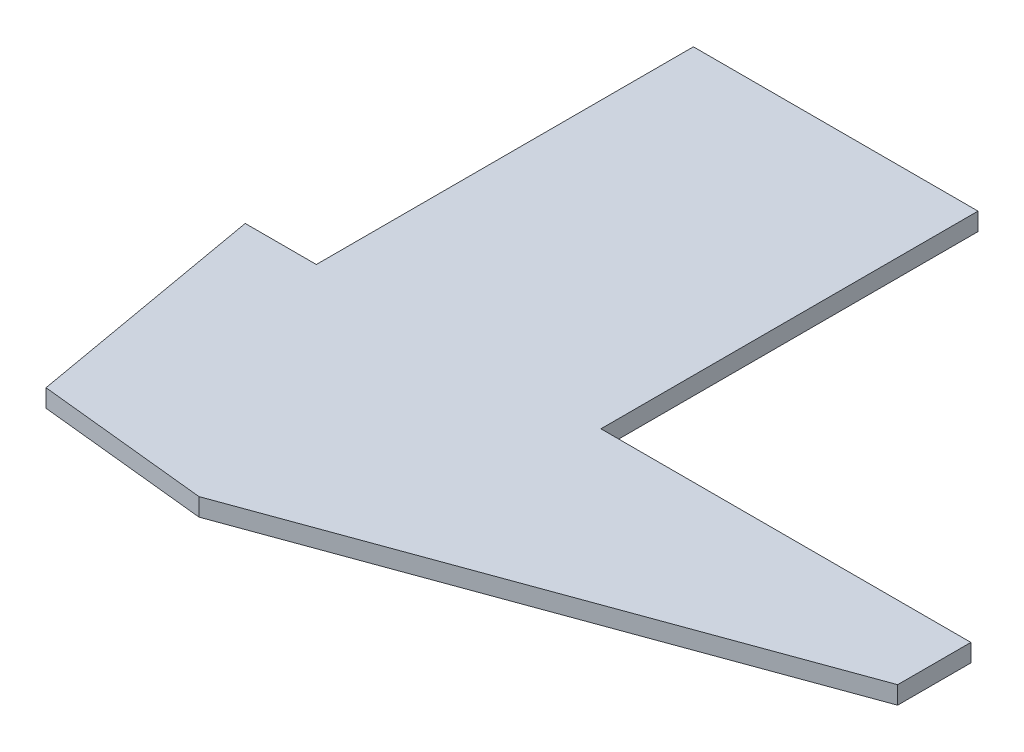
ISO-10303-21;
HEADER;
FILE_DESCRIPTION(('STEP AP214'),'2;1');
FILE_NAME('part.step','',(''),(''),'','','');
FILE_SCHEMA(('AUTOMOTIVE_DESIGN { 1 0 10303 214 1 1 1 1 }'));
ENDSEC;
DATA;
#1=APPLICATION_CONTEXT('core data for automotive mechanical design processes');
#2=APPLICATION_PROTOCOL_DEFINITION('international standard','automotive_design',2000,#1);
#3=PRODUCT_CONTEXT('',#1,'mechanical');
#4=PRODUCT('Part','Part','',(#3));
#5=PRODUCT_RELATED_PRODUCT_CATEGORY('part','',(#4));
#6=PRODUCT_DEFINITION_FORMATION('','',#4);
#7=PRODUCT_DEFINITION_CONTEXT('part definition',#1,'design');
#8=PRODUCT_DEFINITION('design','',#6,#7);
#9=PRODUCT_DEFINITION_SHAPE('','',#8);
#10=(LENGTH_UNIT() NAMED_UNIT(*) SI_UNIT(.MILLI.,.METRE.));
#11=(NAMED_UNIT(*) PLANE_ANGLE_UNIT() SI_UNIT($,.RADIAN.));
#12=(NAMED_UNIT(*) SI_UNIT($,.STERADIAN.) SOLID_ANGLE_UNIT());
#13=UNCERTAINTY_MEASURE_WITH_UNIT(LENGTH_MEASURE(1.E-05),#10,'distance_accuracy_value','');
#14=(GEOMETRIC_REPRESENTATION_CONTEXT(3) GLOBAL_UNCERTAINTY_ASSIGNED_CONTEXT((#13)) GLOBAL_UNIT_ASSIGNED_CONTEXT((#10,
#11,#12)) REPRESENTATION_CONTEXT('',''));
#15=CARTESIAN_POINT('',(0.,0.,0.));
#16=DIRECTION('',(0.,0.,1.));
#17=DIRECTION('',(1.,0.,0.));
#18=AXIS2_PLACEMENT_3D('',#15,#16,#17);
#19=CARTESIAN_POINT('',(-12.7,3.175,0.));
#20=DIRECTION('',(0.,0.,1.));
#21=DIRECTION('',(1.,0.,0.));
#22=AXIS2_PLACEMENT_3D('',#19,#20,#21);
#23=PLANE('',#22);
#24=DIRECTION('',(-1.,0.,0.));
#25=VECTOR('',#24,1.);
#26=CARTESIAN_POINT('',(-12.7,0.,0.));
#27=LINE('',#26,#25);
#28=CARTESIAN_POINT('',(0.,0.,0.));
#29=VERTEX_POINT('',#28);
#30=CARTESIAN_POINT('',(-12.7,0.,0.));
#31=VERTEX_POINT('',#30);
#32=EDGE_CURVE('E151',#29,#31,#27,.T.);
#33=ORIENTED_EDGE('',*,*,#32,.T.);
#34=DIRECTION('',(0.,-1.,0.));
#35=VECTOR('',#34,1.);
#36=CARTESIAN_POINT('',(-12.7,3.175,0.));
#37=LINE('',#36,#35);
#38=CARTESIAN_POINT('',(-12.7,3.175,0.));
#39=VERTEX_POINT('',#38);
#40=EDGE_CURVE('E11',#39,#31,#37,.T.);
#41=ORIENTED_EDGE('',*,*,#40,.F.);
#42=DIRECTION('',(-1.,0.,0.));
#43=VECTOR('',#42,1.);
#44=CARTESIAN_POINT('',(-12.7,3.175,0.));
#45=LINE('',#44,#43);
#46=CARTESIAN_POINT('',(0.,3.175,0.));
#47=VERTEX_POINT('',#46);
#48=EDGE_CURVE('E176',#47,#39,#45,.T.);
#49=ORIENTED_EDGE('',*,*,#48,.F.);
#50=DIRECTION('',(0.,-1.,0.));
#51=VECTOR('',#50,1.);
#52=CARTESIAN_POINT('',(0.,3.175,0.));
#53=LINE('',#52,#51);
#54=EDGE_CURVE('E147',#47,#29,#53,.T.);
#55=ORIENTED_EDGE('',*,*,#54,.T.);
#56=EDGE_LOOP('',(#33,#41,#49,#55));
#57=FACE_BOUND('',#56,.T.);
#58=ADVANCED_FACE('F43',(#57),#23,.F.);
#59=CARTESIAN_POINT('',(-5.07999999999999,3.175,43.18));
#60=DIRECTION('',(0.984783558817937,0.,-0.173785333909048));
#61=DIRECTION('',(-0.173785333909048,0.,-0.984783558817937));
#62=AXIS2_PLACEMENT_3D('',#59,#60,#61);
#63=PLANE('',#62);
#64=DIRECTION('',(0.173785333909048,0.,0.984783558817937));
#65=VECTOR('',#64,1.);
#66=CARTESIAN_POINT('',(-5.07999999999999,0.,43.18));
#67=LINE('',#66,#65);
#68=CARTESIAN_POINT('',(-5.07999999999999,0.,43.18));
#69=VERTEX_POINT('',#68);
#70=EDGE_CURVE('E155',#31,#69,#67,.T.);
#71=ORIENTED_EDGE('',*,*,#70,.T.);
#72=DIRECTION('',(0.,-1.,0.));
#73=VECTOR('',#72,1.);
#74=CARTESIAN_POINT('',(-5.07999999999999,3.175,43.18));
#75=LINE('',#74,#73);
#76=CARTESIAN_POINT('',(-5.07999999999999,3.175,43.18));
#77=VERTEX_POINT('',#76);
#78=EDGE_CURVE('E52',#77,#69,#75,.T.);
#79=ORIENTED_EDGE('',*,*,#78,.F.);
#80=DIRECTION('',(0.173785333909048,0.,0.984783558817937));
#81=VECTOR('',#80,1.);
#82=CARTESIAN_POINT('',(-5.07999999999999,3.175,43.18));
#83=LINE('',#82,#81);
#84=EDGE_CURVE('E106',#39,#77,#83,.T.);
#85=ORIENTED_EDGE('',*,*,#84,.F.);
#86=ORIENTED_EDGE('',*,*,#40,.T.);
#87=EDGE_LOOP('',(#71,#79,#85,#86));
#88=FACE_BOUND('',#87,.T.);
#89=ADVANCED_FACE('F235',(#88),#63,.F.);
#90=CARTESIAN_POINT('',(25.4,3.175,46.355));
#91=DIRECTION('',(0.103606084259456,0.,-0.994618408890778));
#92=DIRECTION('',(-0.994618408890778,0.,-0.103606084259456));
#93=AXIS2_PLACEMENT_3D('',#90,#91,#92);
#94=PLANE('',#93);
#95=DIRECTION('',(0.994618408890778,0.,0.103606084259456));
#96=VECTOR('',#95,1.);
#97=CARTESIAN_POINT('',(25.4,0.,46.355));
#98=LINE('',#97,#96);
#99=CARTESIAN_POINT('',(25.4,0.,46.355));
#100=VERTEX_POINT('',#99);
#101=EDGE_CURVE('E158',#69,#100,#98,.T.);
#102=ORIENTED_EDGE('',*,*,#101,.T.);
#103=DIRECTION('',(0.,-1.,0.));
#104=VECTOR('',#103,1.);
#105=CARTESIAN_POINT('',(25.4,3.175,46.355));
#106=LINE('',#105,#104);
#107=CARTESIAN_POINT('',(25.4,3.175,46.355));
#108=VERTEX_POINT('',#107);
#109=EDGE_CURVE('E191',#108,#100,#106,.T.);
#110=ORIENTED_EDGE('',*,*,#109,.F.);
#111=DIRECTION('',(0.994618408890778,0.,0.103606084259456));
#112=VECTOR('',#111,1.);
#113=CARTESIAN_POINT('',(25.4,3.175,46.355));
#114=LINE('',#113,#112);
#115=EDGE_CURVE('E202',#77,#108,#114,.T.);
#116=ORIENTED_EDGE('',*,*,#115,.F.);
#117=ORIENTED_EDGE('',*,*,#78,.T.);
#118=EDGE_LOOP('',(#102,#110,#116,#117));
#119=FACE_BOUND('',#118,.T.);
#120=ADVANCED_FACE('F200',(#119),#94,.F.);
#121=CARTESIAN_POINT('',(25.4,3.175,46.355));
#122=DIRECTION('',(-0.342020143325666,0.,-0.939692620785909));
#123=DIRECTION('',(-0.939692620785909,0.,0.342020143325666));
#124=AXIS2_PLACEMENT_3D('',#121,#122,#123);
#125=PLANE('',#124);
#126=DIRECTION('',(0.939692620785909,0.,-0.342020143325666));
#127=VECTOR('',#126,1.);
#128=CARTESIAN_POINT('',(25.4,0.,46.355));
#129=LINE('',#128,#127);
#130=CARTESIAN_POINT('',(116.84,0.,13.0735617786987));
#131=VERTEX_POINT('',#130);
#132=EDGE_CURVE('E161',#100,#131,#129,.T.);
#133=ORIENTED_EDGE('',*,*,#132,.T.);
#134=DIRECTION('',(0.,-1.,0.));
#135=VECTOR('',#134,1.);
#136=CARTESIAN_POINT('',(116.84,3.175,13.0735617786987));
#137=LINE('',#136,#135);
#138=CARTESIAN_POINT('',(116.84,3.175,13.0735617786987));
#139=VERTEX_POINT('',#138);
#140=EDGE_CURVE('E187',#139,#131,#137,.T.);
#141=ORIENTED_EDGE('',*,*,#140,.F.);
#142=DIRECTION('',(0.939692620785909,0.,-0.342020143325666));
#143=VECTOR('',#142,1.);
#144=CARTESIAN_POINT('',(25.4,3.175,46.355));
#145=LINE('',#144,#143);
#146=EDGE_CURVE('E219',#108,#139,#145,.T.);
#147=ORIENTED_EDGE('',*,*,#146,.F.);
#148=ORIENTED_EDGE('',*,*,#109,.T.);
#149=EDGE_LOOP('',(#133,#141,#147,#148));
#150=FACE_BOUND('',#149,.T.);
#151=ADVANCED_FACE('F211',(#150),#125,.F.);
#152=CARTESIAN_POINT('',(116.84,3.175,13.0735617786987));
#153=DIRECTION('',(-1.,0.,0.));
#154=DIRECTION('',(0.,0.,1.));
#155=AXIS2_PLACEMENT_3D('',#152,#153,#154);
#156=PLANE('',#155);
#157=DIRECTION('',(0.,0.,-1.));
#158=VECTOR('',#157,1.);
#159=CARTESIAN_POINT('',(116.84,0.,13.0735617786987));
#160=LINE('',#159,#158);
#161=CARTESIAN_POINT('',(116.84,0.,0.));
#162=VERTEX_POINT('',#161);
#163=EDGE_CURVE('E164',#131,#162,#160,.T.);
#164=ORIENTED_EDGE('',*,*,#163,.T.);
#165=DIRECTION('',(0.,-1.,0.));
#166=VECTOR('',#165,1.);
#167=CARTESIAN_POINT('',(116.84,3.175,0.));
#168=LINE('',#167,#166);
#169=CARTESIAN_POINT('',(116.84,3.175,0.));
#170=VERTEX_POINT('',#169);
#171=EDGE_CURVE('E183',#170,#162,#168,.T.);
#172=ORIENTED_EDGE('',*,*,#171,.F.);
#173=DIRECTION('',(0.,0.,-1.));
#174=VECTOR('',#173,1.);
#175=CARTESIAN_POINT('',(116.84,3.175,13.0735617786987));
#176=LINE('',#175,#174);
#177=EDGE_CURVE('E217',#139,#170,#176,.T.);
#178=ORIENTED_EDGE('',*,*,#177,.F.);
#179=ORIENTED_EDGE('',*,*,#140,.T.);
#180=EDGE_LOOP('',(#164,#172,#178,#179));
#181=FACE_BOUND('',#180,.T.);
#182=ADVANCED_FACE('F215',(#181),#156,.F.);
#183=CARTESIAN_POINT('',(50.8,3.175,0.));
#184=DIRECTION('',(0.,0.,1.));
#185=DIRECTION('',(1.,0.,0.));
#186=AXIS2_PLACEMENT_3D('',#183,#184,#185);
#187=PLANE('',#186);
#188=DIRECTION('',(-1.,0.,0.));
#189=VECTOR('',#188,1.);
#190=CARTESIAN_POINT('',(50.8,0.,0.));
#191=LINE('',#190,#189);
#192=CARTESIAN_POINT('',(50.8,0.,0.));
#193=VERTEX_POINT('',#192);
#194=EDGE_CURVE('E167',#162,#193,#191,.T.);
#195=ORIENTED_EDGE('',*,*,#194,.T.);
#196=DIRECTION('',(0.,-1.,0.));
#197=VECTOR('',#196,1.);
#198=CARTESIAN_POINT('',(50.8,3.175,0.));
#199=LINE('',#198,#197);
#200=CARTESIAN_POINT('',(50.8,3.175,0.));
#201=VERTEX_POINT('',#200);
#202=EDGE_CURVE('E139',#201,#193,#199,.T.);
#203=ORIENTED_EDGE('',*,*,#202,.F.);
#204=DIRECTION('',(-1.,0.,0.));
#205=VECTOR('',#204,1.);
#206=CARTESIAN_POINT('',(50.8,3.175,0.));
#207=LINE('',#206,#205);
#208=EDGE_CURVE('E128',#170,#201,#207,.T.);
#209=ORIENTED_EDGE('',*,*,#208,.F.);
#210=ORIENTED_EDGE('',*,*,#171,.T.);
#211=EDGE_LOOP('',(#195,#203,#209,#210));
#212=FACE_BOUND('',#211,.T.);
#213=ADVANCED_FACE('F247',(#212),#187,.F.);
#214=CARTESIAN_POINT('',(50.8,3.175,0.));
#215=DIRECTION('',(-1.,0.,0.));
#216=DIRECTION('',(0.,0.,1.));
#217=AXIS2_PLACEMENT_3D('',#214,#215,#216);
#218=PLANE('',#217);
#219=DIRECTION('',(0.,0.,-1.));
#220=VECTOR('',#219,1.);
#221=CARTESIAN_POINT('',(50.8,0.,0.));
#222=LINE('',#221,#220);
#223=CARTESIAN_POINT('',(50.8,0.,-67.31));
#224=VERTEX_POINT('',#223);
#225=EDGE_CURVE('E137',#193,#224,#222,.T.);
#226=ORIENTED_EDGE('',*,*,#225,.T.);
#227=DIRECTION('',(0.,-1.,0.));
#228=VECTOR('',#227,1.);
#229=CARTESIAN_POINT('',(50.8,3.175,-67.31));
#230=LINE('',#229,#228);
#231=CARTESIAN_POINT('',(50.8,3.175,-67.31));
#232=VERTEX_POINT('',#231);
#233=EDGE_CURVE('E134',#232,#224,#230,.T.);
#234=ORIENTED_EDGE('',*,*,#233,.F.);
#235=DIRECTION('',(0.,0.,-1.));
#236=VECTOR('',#235,1.);
#237=CARTESIAN_POINT('',(50.8,3.175,0.));
#238=LINE('',#237,#236);
#239=EDGE_CURVE('E122',#201,#232,#238,.T.);
#240=ORIENTED_EDGE('',*,*,#239,.F.);
#241=ORIENTED_EDGE('',*,*,#202,.T.);
#242=EDGE_LOOP('',(#226,#234,#240,#241));
#243=FACE_BOUND('',#242,.T.);
#244=ADVANCED_FACE('F135',(#243),#218,.F.);
#245=CARTESIAN_POINT('',(0.,3.175,-67.31));
#246=DIRECTION('',(0.,0.,1.));
#247=DIRECTION('',(1.,0.,0.));
#248=AXIS2_PLACEMENT_3D('',#245,#246,#247);
#249=PLANE('',#248);
#250=DIRECTION('',(-1.,0.,0.));
#251=VECTOR('',#250,1.);
#252=CARTESIAN_POINT('',(0.,0.,-67.31));
#253=LINE('',#252,#251);
#254=CARTESIAN_POINT('',(0.,0.,-67.31));
#255=VERTEX_POINT('',#254);
#256=EDGE_CURVE('E92',#224,#255,#253,.T.);
#257=ORIENTED_EDGE('',*,*,#256,.T.);
#258=DIRECTION('',(0.,-1.,0.));
#259=VECTOR('',#258,1.);
#260=CARTESIAN_POINT('',(0.,3.175,-67.31));
#261=LINE('',#260,#259);
#262=CARTESIAN_POINT('',(0.,3.175,-67.31));
#263=VERTEX_POINT('',#262);
#264=EDGE_CURVE('E140',#263,#255,#261,.T.);
#265=ORIENTED_EDGE('',*,*,#264,.F.);
#266=DIRECTION('',(-1.,0.,0.));
#267=VECTOR('',#266,1.);
#268=CARTESIAN_POINT('',(0.,3.175,-67.31));
#269=LINE('',#268,#267);
#270=EDGE_CURVE('E126',#232,#263,#269,.T.);
#271=ORIENTED_EDGE('',*,*,#270,.F.);
#272=ORIENTED_EDGE('',*,*,#233,.T.);
#273=EDGE_LOOP('',(#257,#265,#271,#272));
#274=FACE_BOUND('',#273,.T.);
#275=ADVANCED_FACE('F142',(#274),#249,.F.);
#276=CARTESIAN_POINT('',(0.,3.175,0.));
#277=DIRECTION('',(1.,0.,0.));
#278=DIRECTION('',(0.,0.,-1.));
#279=AXIS2_PLACEMENT_3D('',#276,#277,#278);
#280=PLANE('',#279);
#281=DIRECTION('',(0.,0.,1.));
#282=VECTOR('',#281,1.);
#283=CARTESIAN_POINT('',(0.,0.,0.));
#284=LINE('',#283,#282);
#285=EDGE_CURVE('E98',#255,#29,#284,.T.);
#286=ORIENTED_EDGE('',*,*,#285,.T.);
#287=ORIENTED_EDGE('',*,*,#54,.F.);
#288=DIRECTION('',(0.,0.,1.));
#289=VECTOR('',#288,1.);
#290=CARTESIAN_POINT('',(0.,3.175,0.));
#291=LINE('',#290,#289);
#292=EDGE_CURVE('E60',#263,#47,#291,.T.);
#293=ORIENTED_EDGE('',*,*,#292,.F.);
#294=ORIENTED_EDGE('',*,*,#264,.T.);
#295=EDGE_LOOP('',(#286,#287,#293,#294));
#296=FACE_BOUND('',#295,.T.);
#297=ADVANCED_FACE('F255',(#296),#280,.F.);
#298=CARTESIAN_POINT('',(0.,3.175,0.));
#299=DIRECTION('',(0.,1.,0.));
#300=DIRECTION('',(0.,0.,1.));
#301=AXIS2_PLACEMENT_3D('',#298,#299,#300);
#302=PLANE('',#301);
#303=ORIENTED_EDGE('',*,*,#48,.T.);
#304=ORIENTED_EDGE('',*,*,#84,.T.);
#305=ORIENTED_EDGE('',*,*,#115,.T.);
#306=ORIENTED_EDGE('',*,*,#146,.T.);
#307=ORIENTED_EDGE('',*,*,#177,.T.);
#308=ORIENTED_EDGE('',*,*,#208,.T.);
#309=ORIENTED_EDGE('',*,*,#239,.T.);
#310=ORIENTED_EDGE('',*,*,#270,.T.);
#311=ORIENTED_EDGE('',*,*,#292,.T.);
#312=EDGE_LOOP('',(#303,#304,#305,#306,#307,#308,#309,#310,#311));
#313=FACE_BOUND('',#312,.T.);
#314=ADVANCED_FACE('F124',(#313),#302,.T.);
#315=CARTESIAN_POINT('',(0.,0.,0.));
#316=DIRECTION('',(0.,1.,0.));
#317=DIRECTION('',(0.,0.,1.));
#318=AXIS2_PLACEMENT_3D('',#315,#316,#317);
#319=PLANE('',#318);
#320=ORIENTED_EDGE('',*,*,#32,.F.);
#321=ORIENTED_EDGE('',*,*,#285,.F.);
#322=ORIENTED_EDGE('',*,*,#256,.F.);
#323=ORIENTED_EDGE('',*,*,#225,.F.);
#324=ORIENTED_EDGE('',*,*,#194,.F.);
#325=ORIENTED_EDGE('',*,*,#163,.F.);
#326=ORIENTED_EDGE('',*,*,#132,.F.);
#327=ORIENTED_EDGE('',*,*,#101,.F.);
#328=ORIENTED_EDGE('',*,*,#70,.F.);
#329=EDGE_LOOP('',(#320,#321,#322,#323,#324,#325,#326,#327,#328));
#330=FACE_BOUND('',#329,.T.);
#331=ADVANCED_FACE('F206',(#330),#319,.F.);
#332=CLOSED_SHELL('',(#58,#89,#120,#151,#182,#213,#244,#275,#297,#314,#331));
#333=MANIFOLD_SOLID_BREP('B2',#332);
#334=ADVANCED_BREP_SHAPE_REPRESENTATION('',(#18,#333),#14);
#335=SHAPE_DEFINITION_REPRESENTATION(#9,#334);
ENDSEC;
END-ISO-10303-21;
